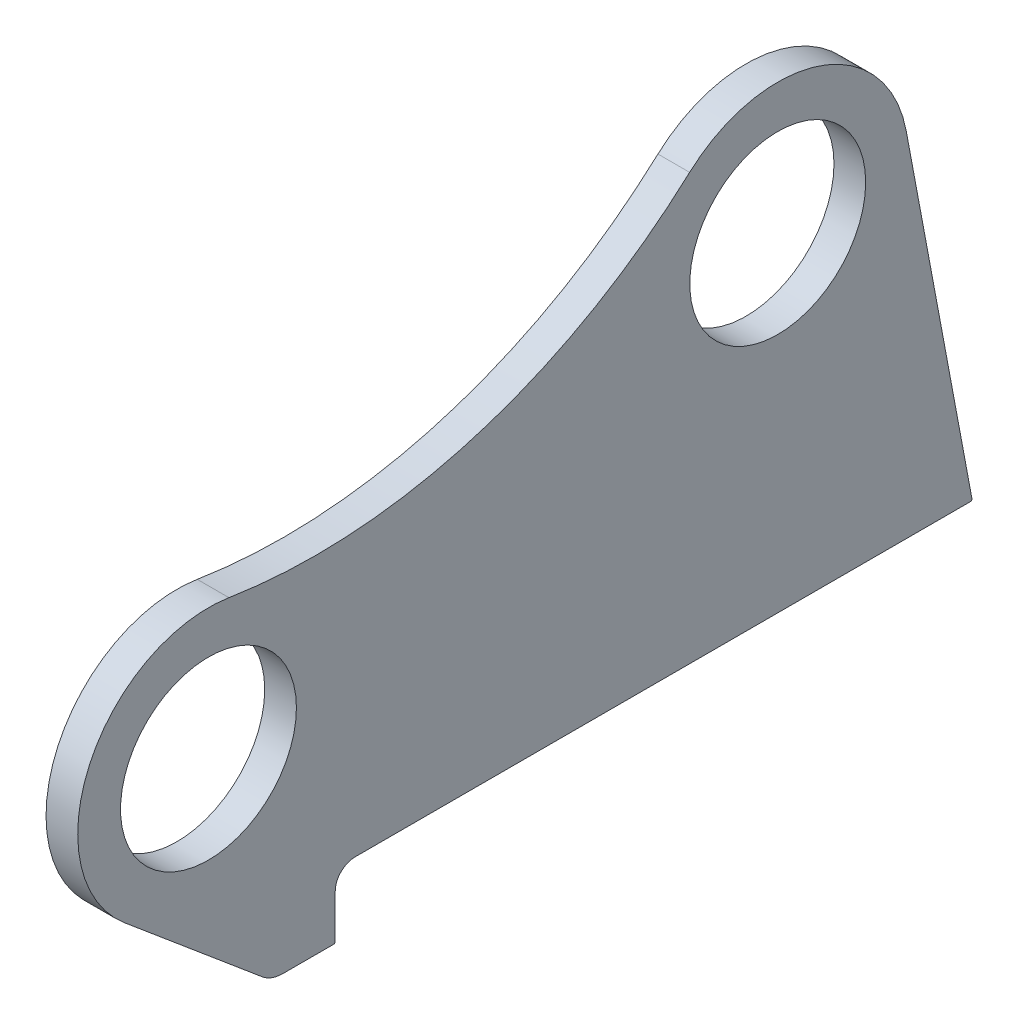
ISO-10303-21;
HEADER;
FILE_DESCRIPTION(('STEP AP214'),'2;1');
FILE_NAME('part.step','',(''),(''),'','','');
FILE_SCHEMA(('AUTOMOTIVE_DESIGN { 1 0 10303 214 1 1 1 1 }'));
ENDSEC;
DATA;
#1=APPLICATION_CONTEXT('core data for automotive mechanical design processes');
#2=APPLICATION_PROTOCOL_DEFINITION('international standard','automotive_design',2000,#1);
#3=PRODUCT_CONTEXT('',#1,'mechanical');
#4=PRODUCT('Part','Part','',(#3));
#5=PRODUCT_RELATED_PRODUCT_CATEGORY('part','',(#4));
#6=PRODUCT_DEFINITION_FORMATION('','',#4);
#7=PRODUCT_DEFINITION_CONTEXT('part definition',#1,'design');
#8=PRODUCT_DEFINITION('design','',#6,#7);
#9=PRODUCT_DEFINITION_SHAPE('','',#8);
#10=(LENGTH_UNIT() NAMED_UNIT(*) SI_UNIT(.MILLI.,.METRE.));
#11=(NAMED_UNIT(*) PLANE_ANGLE_UNIT() SI_UNIT($,.RADIAN.));
#12=(NAMED_UNIT(*) SI_UNIT($,.STERADIAN.) SOLID_ANGLE_UNIT());
#13=UNCERTAINTY_MEASURE_WITH_UNIT(LENGTH_MEASURE(1.E-05),#10,'distance_accuracy_value','');
#14=(GEOMETRIC_REPRESENTATION_CONTEXT(3) GLOBAL_UNCERTAINTY_ASSIGNED_CONTEXT((#13)) GLOBAL_UNIT_ASSIGNED_CONTEXT((#10,
#11,#12)) REPRESENTATION_CONTEXT('',''));
#15=CARTESIAN_POINT('',(0.,0.,0.));
#16=DIRECTION('',(0.,0.,1.));
#17=DIRECTION('',(1.,0.,0.));
#18=AXIS2_PLACEMENT_3D('',#15,#16,#17);
#19=CARTESIAN_POINT('',(-20.,527.155619983624,12.2185400245114));
#20=DIRECTION('',(1.,0.,0.));
#21=DIRECTION('',(0.,0.,-1.));
#22=AXIS2_PLACEMENT_3D('',#19,#20,#21);
#23=CYLINDRICAL_SURFACE('',#22,350.);
#24=CARTESIAN_POINT('',(0.,527.155619983624,12.2185400245114));
#25=DIRECTION('',(-1.,0.,0.));
#26=DIRECTION('',(0.,0.,-1.));
#27=AXIS2_PLACEMENT_3D('',#24,#25,#26);
#28=CIRCLE('',#27,350.);
#29=CARTESIAN_POINT('',(0.,268.558327081387,-223.636161229534));
#30=VERTEX_POINT('',#29);
#31=CARTESIAN_POINT('',(0.,181.480551788787,67.0705885595889));
#32=VERTEX_POINT('',#31);
#33=EDGE_CURVE('E179',#30,#32,#28,.T.);
#34=ORIENTED_EDGE('',*,*,#33,.F.);
#35=DIRECTION('',(1.,0.,0.));
#36=VECTOR('',#35,1.);
#37=CARTESIAN_POINT('',(-20.,268.558327081387,-223.636161229534));
#38=LINE('',#37,#36);
#39=CARTESIAN_POINT('',(-20.,268.558327081387,-223.636161229534));
#40=VERTEX_POINT('',#39);
#41=EDGE_CURVE('E152',#40,#30,#38,.T.);
#42=ORIENTED_EDGE('',*,*,#41,.F.);
#43=CARTESIAN_POINT('',(-20.,527.155619983624,12.2185400245114));
#44=DIRECTION('',(-1.,0.,0.));
#45=DIRECTION('',(0.,0.,-1.));
#46=AXIS2_PLACEMENT_3D('',#43,#44,#45);
#47=CIRCLE('',#46,350.);
#48=CARTESIAN_POINT('',(-20.,181.480551788787,67.0705885595889));
#49=VERTEX_POINT('',#48);
#50=EDGE_CURVE('E146',#40,#49,#47,.T.);
#51=ORIENTED_EDGE('',*,*,#50,.T.);
#52=DIRECTION('',(1.,0.,0.));
#53=VECTOR('',#52,1.);
#54=CARTESIAN_POINT('',(-20.,181.480551788787,67.0705885595889));
#55=LINE('',#54,#53);
#56=EDGE_CURVE('E128',#49,#32,#55,.T.);
#57=ORIENTED_EDGE('',*,*,#56,.T.);
#58=EDGE_LOOP('',(#34,#42,#51,#57));
#59=FACE_BOUND('',#58,.T.);
#60=ADVANCED_FACE('F39',(#59),#23,.F.);
#61=CARTESIAN_POINT('',(-20.,207.603250897289,-279.230483667987));
#62=DIRECTION('',(1.,0.,0.));
#63=DIRECTION('',(0.,0.,-1.));
#64=AXIS2_PLACEMENT_3D('',#61,#62,#63);
#65=CYLINDRICAL_SURFACE('',#64,82.5);
#66=CARTESIAN_POINT('',(0.,207.603250897289,-279.230483667987));
#67=DIRECTION('',(1.,0.,0.));
#68=DIRECTION('',(0.,0.,-1.));
#69=AXIS2_PLACEMENT_3D('',#66,#67,#68);
#70=CIRCLE('',#69,82.5);
#71=CARTESIAN_POINT('',(0.,222.774084628705,-360.323614103886));
#72=VERTEX_POINT('',#71);
#73=EDGE_CURVE('E153',#72,#30,#70,.T.);
#74=ORIENTED_EDGE('',*,*,#73,.F.);
#75=DIRECTION('',(1.,0.,0.));
#76=VECTOR('',#75,1.);
#77=CARTESIAN_POINT('',(-20.,222.774084628705,-360.323614103886));
#78=LINE('',#77,#76);
#79=CARTESIAN_POINT('',(-20.,222.774084628705,-360.323614103886));
#80=VERTEX_POINT('',#79);
#81=EDGE_CURVE('E203',#80,#72,#78,.T.);
#82=ORIENTED_EDGE('',*,*,#81,.F.);
#83=CARTESIAN_POINT('',(-20.,207.603250897289,-279.230483667987));
#84=DIRECTION('',(1.,0.,0.));
#85=DIRECTION('',(0.,0.,-1.));
#86=AXIS2_PLACEMENT_3D('',#83,#84,#85);
#87=CIRCLE('',#86,82.5);
#88=EDGE_CURVE('E139',#80,#40,#87,.T.);
#89=ORIENTED_EDGE('',*,*,#88,.T.);
#90=ORIENTED_EDGE('',*,*,#41,.T.);
#91=EDGE_LOOP('',(#74,#82,#89,#90));
#92=FACE_BOUND('',#91,.T.);
#93=ADVANCED_FACE('F244',(#92),#65,.T.);
#94=CARTESIAN_POINT('',(-20.,0.,-402.));
#95=DIRECTION('',(0.,0.183888893714131,-0.982947035586655));
#96=DIRECTION('',(0.,0.982947035586655,0.183888893714131));
#97=AXIS2_PLACEMENT_3D('',#94,#95,#96);
#98=PLANE('',#97);
#99=DIRECTION('',(0.,0.982947035586655,0.183888893714131));
#100=VECTOR('',#99,1.);
#101=CARTESIAN_POINT('',(0.,0.,-402.));
#102=LINE('',#101,#100);
#103=CARTESIAN_POINT('',(0.,1.18388889371413,-401.778519074717));
#104=VERTEX_POINT('',#103);
#105=EDGE_CURVE('E156',#104,#72,#102,.T.);
#106=ORIENTED_EDGE('',*,*,#105,.F.);
#107=DIRECTION('',(1.,0.,0.));
#108=VECTOR('',#107,1.);
#109=CARTESIAN_POINT('',(-20.,1.18388889371413,-401.778519074717));
#110=LINE('',#109,#108);
#111=CARTESIAN_POINT('',(-20.,1.18388889371413,-401.778519074717));
#112=VERTEX_POINT('',#111);
#113=EDGE_CURVE('E222',#104,#112,#110,.F.);
#114=ORIENTED_EDGE('',*,*,#113,.T.);
#115=DIRECTION('',(0.,0.982947035586655,0.183888893714131));
#116=VECTOR('',#115,1.);
#117=CARTESIAN_POINT('',(-20.,0.,-402.));
#118=LINE('',#117,#116);
#119=EDGE_CURVE('E176',#112,#80,#118,.T.);
#120=ORIENTED_EDGE('',*,*,#119,.T.);
#121=ORIENTED_EDGE('',*,*,#81,.T.);
#122=EDGE_LOOP('',(#106,#114,#120,#121));
#123=FACE_BOUND('',#122,.T.);
#124=ADVANCED_FACE('F270',(#123),#98,.T.);
#125=CARTESIAN_POINT('',(-20.,0.,-12.5));
#126=DIRECTION('',(0.,-1.,0.));
#127=DIRECTION('',(0.,0.,-1.));
#128=AXIS2_PLACEMENT_3D('',#125,#126,#127);
#129=PLANE('',#128);
#130=DIRECTION('',(0.,0.,-1.));
#131=VECTOR('',#130,1.);
#132=CARTESIAN_POINT('',(-20.,0.,-12.5));
#133=LINE('',#132,#131);
#134=CARTESIAN_POINT('',(-20.,0.,-12.5));
#135=VERTEX_POINT('',#134);
#136=CARTESIAN_POINT('',(-20.,0.,-400.795572039131));
#137=VERTEX_POINT('',#136);
#138=EDGE_CURVE('E173',#135,#137,#133,.T.);
#139=ORIENTED_EDGE('',*,*,#138,.T.);
#140=DIRECTION('',(1.,0.,0.));
#141=VECTOR('',#140,1.);
#142=CARTESIAN_POINT('',(-20.,0.,-400.795572039131));
#143=LINE('',#142,#141);
#144=CARTESIAN_POINT('',(0.,0.,-400.795572039131));
#145=VERTEX_POINT('',#144);
#146=EDGE_CURVE('E202',#137,#145,#143,.T.);
#147=ORIENTED_EDGE('',*,*,#146,.T.);
#148=DIRECTION('',(0.,0.,-1.));
#149=VECTOR('',#148,1.);
#150=CARTESIAN_POINT('',(0.,0.,-12.5));
#151=LINE('',#150,#149);
#152=CARTESIAN_POINT('',(0.,0.,-12.5));
#153=VERTEX_POINT('',#152);
#154=EDGE_CURVE('E197',#153,#145,#151,.T.);
#155=ORIENTED_EDGE('',*,*,#154,.F.);
#156=DIRECTION('',(1.,0.,0.));
#157=VECTOR('',#156,1.);
#158=CARTESIAN_POINT('',(-20.,0.,-12.5));
#159=LINE('',#158,#157);
#160=EDGE_CURVE('E206',#135,#153,#159,.T.);
#161=ORIENTED_EDGE('',*,*,#160,.F.);
#162=EDGE_LOOP('',(#139,#147,#155,#161));
#163=FACE_BOUND('',#162,.T.);
#164=ADVANCED_FACE('F254',(#163),#129,.T.);
#165=CARTESIAN_POINT('',(-20.,-12.5,-12.5));
#166=DIRECTION('',(1.,0.,0.));
#167=DIRECTION('',(0.,0.,-1.));
#168=AXIS2_PLACEMENT_3D('',#165,#166,#167);
#169=CYLINDRICAL_SURFACE('',#168,12.5);
#170=CARTESIAN_POINT('',(0.,-12.5,-12.5));
#171=DIRECTION('',(-1.,0.,0.));
#172=DIRECTION('',(0.,0.,1.));
#173=AXIS2_PLACEMENT_3D('',#170,#171,#172);
#174=CIRCLE('',#173,12.5);
#175=CARTESIAN_POINT('',(0.,-12.5,0.));
#176=VERTEX_POINT('',#175);
#177=EDGE_CURVE('E194',#176,#153,#174,.T.);
#178=ORIENTED_EDGE('',*,*,#177,.F.);
#179=DIRECTION('',(1.,0.,0.));
#180=VECTOR('',#179,1.);
#181=CARTESIAN_POINT('',(-20.,-12.5,0.));
#182=LINE('',#181,#180);
#183=CARTESIAN_POINT('',(-20.,-12.5,0.));
#184=VERTEX_POINT('',#183);
#185=EDGE_CURVE('E208',#184,#176,#182,.T.);
#186=ORIENTED_EDGE('',*,*,#185,.F.);
#187=CARTESIAN_POINT('',(-20.,-12.5,-12.5));
#188=DIRECTION('',(-1.,0.,0.));
#189=DIRECTION('',(0.,0.,1.));
#190=AXIS2_PLACEMENT_3D('',#187,#188,#189);
#191=CIRCLE('',#190,12.5);
#192=EDGE_CURVE('E170',#184,#135,#191,.T.);
#193=ORIENTED_EDGE('',*,*,#192,.T.);
#194=ORIENTED_EDGE('',*,*,#160,.T.);
#195=EDGE_LOOP('',(#178,#186,#193,#194));
#196=FACE_BOUND('',#195,.T.);
#197=ADVANCED_FACE('F258',(#196),#169,.F.);
#198=CARTESIAN_POINT('',(-20.,-41.,0.));
#199=DIRECTION('',(0.,0.,-1.));
#200=DIRECTION('',(-1.,0.,0.));
#201=AXIS2_PLACEMENT_3D('',#198,#199,#200);
#202=PLANE('',#201);
#203=DIRECTION('',(0.,1.,0.));
#204=VECTOR('',#203,1.);
#205=CARTESIAN_POINT('',(0.,-41.,0.));
#206=LINE('',#205,#204);
#207=CARTESIAN_POINT('',(0.,-40.,0.));
#208=VERTEX_POINT('',#207);
#209=EDGE_CURVE('E192',#208,#176,#206,.T.);
#210=ORIENTED_EDGE('',*,*,#209,.F.);
#211=DIRECTION('',(1.,0.,0.));
#212=VECTOR('',#211,1.);
#213=CARTESIAN_POINT('',(-20.,-40.,0.));
#214=LINE('',#213,#212);
#215=CARTESIAN_POINT('',(-20.,-40.,0.));
#216=VERTEX_POINT('',#215);
#217=EDGE_CURVE('E11',#208,#216,#214,.F.);
#218=ORIENTED_EDGE('',*,*,#217,.T.);
#219=DIRECTION('',(0.,1.,0.));
#220=VECTOR('',#219,1.);
#221=CARTESIAN_POINT('',(-20.,-41.,0.));
#222=LINE('',#221,#220);
#223=EDGE_CURVE('E168',#216,#184,#222,.T.);
#224=ORIENTED_EDGE('',*,*,#223,.T.);
#225=ORIENTED_EDGE('',*,*,#185,.T.);
#226=EDGE_LOOP('',(#210,#218,#224,#225));
#227=FACE_BOUND('',#226,.T.);
#228=ADVANCED_FACE('F281',(#227),#202,.T.);
#229=CARTESIAN_POINT('',(-20.,-41.,0.));
#230=DIRECTION('',(0.,-1.,0.));
#231=DIRECTION('',(0.,0.,-1.));
#232=AXIS2_PLACEMENT_3D('',#229,#230,#231);
#233=PLANE('',#232);
#234=DIRECTION('',(0.,0.,-1.));
#235=VECTOR('',#234,1.);
#236=CARTESIAN_POINT('',(-20.,-41.,0.));
#237=LINE('',#236,#235);
#238=CARTESIAN_POINT('',(-20.,-41.,33.1096120214944));
#239=VERTEX_POINT('',#238);
#240=CARTESIAN_POINT('',(-20.,-41.,1.));
#241=VERTEX_POINT('',#240);
#242=EDGE_CURVE('E166',#239,#241,#237,.T.);
#243=ORIENTED_EDGE('',*,*,#242,.T.);
#244=DIRECTION('',(1.,0.,0.));
#245=VECTOR('',#244,1.);
#246=CARTESIAN_POINT('',(-20.,-41.,1.));
#247=LINE('',#246,#245);
#248=CARTESIAN_POINT('',(0.,-41.,1.));
#249=VERTEX_POINT('',#248);
#250=EDGE_CURVE('E47',#241,#249,#247,.T.);
#251=ORIENTED_EDGE('',*,*,#250,.T.);
#252=DIRECTION('',(0.,0.,-1.));
#253=VECTOR('',#252,1.);
#254=CARTESIAN_POINT('',(0.,-41.,0.));
#255=LINE('',#254,#253);
#256=CARTESIAN_POINT('',(0.,-41.,33.1096120214944));
#257=VERTEX_POINT('',#256);
#258=EDGE_CURVE('E189',#257,#249,#255,.T.);
#259=ORIENTED_EDGE('',*,*,#258,.F.);
#260=DIRECTION('',(1.,0.,0.));
#261=VECTOR('',#260,1.);
#262=CARTESIAN_POINT('',(-20.,-41.,33.1096120214944));
#263=LINE('',#262,#261);
#264=EDGE_CURVE('E211',#239,#257,#263,.T.);
#265=ORIENTED_EDGE('',*,*,#264,.F.);
#266=EDGE_LOOP('',(#243,#251,#259,#265));
#267=FACE_BOUND('',#266,.T.);
#268=ADVANCED_FACE('F230',(#267),#233,.T.);
#269=CARTESIAN_POINT('',(-20.,-21.,33.1096120214943));
#270=DIRECTION('',(1.,0.,0.));
#271=DIRECTION('',(0.,0.,-1.));
#272=AXIS2_PLACEMENT_3D('',#269,#270,#271);
#273=CYLINDRICAL_SURFACE('',#272,20.);
#274=CARTESIAN_POINT('',(0.,-21.,33.1096120214943));
#275=DIRECTION('',(1.,0.,0.));
#276=DIRECTION('',(0.,0.,-1.));
#277=AXIS2_PLACEMENT_3D('',#274,#275,#276);
#278=CIRCLE('',#277,20.);
#279=CARTESIAN_POINT('',(0.,-36.3151421434658,45.972209781101));
#280=VERTEX_POINT('',#279);
#281=EDGE_CURVE('E186',#280,#257,#278,.T.);
#282=ORIENTED_EDGE('',*,*,#281,.F.);
#283=DIRECTION('',(1.,0.,0.));
#284=VECTOR('',#283,1.);
#285=CARTESIAN_POINT('',(-20.,-36.3151421434658,45.972209781101));
#286=LINE('',#285,#284);
#287=CARTESIAN_POINT('',(-20.,-36.3151421434658,45.972209781101));
#288=VERTEX_POINT('',#287);
#289=EDGE_CURVE('E213',#288,#280,#286,.T.);
#290=ORIENTED_EDGE('',*,*,#289,.F.);
#291=CARTESIAN_POINT('',(-20.,-21.,33.1096120214943));
#292=DIRECTION('',(1.,0.,0.));
#293=DIRECTION('',(0.,0.,-1.));
#294=AXIS2_PLACEMENT_3D('',#291,#292,#293);
#295=CIRCLE('',#294,20.);
#296=EDGE_CURVE('E163',#288,#239,#295,.T.);
#297=ORIENTED_EDGE('',*,*,#296,.T.);
#298=ORIENTED_EDGE('',*,*,#264,.T.);
#299=EDGE_LOOP('',(#282,#290,#297,#298));
#300=FACE_BOUND('',#299,.T.);
#301=ADVANCED_FACE('F237',(#300),#273,.T.);
#302=CARTESIAN_POINT('',(-20.,36.8250386582074,133.058215758378));
#303=DIRECTION('',(0.,-0.765757107173288,0.643129887980334));
#304=DIRECTION('',(0.,-0.643129887980334,-0.765757107173288));
#305=AXIS2_PLACEMENT_3D('',#302,#303,#304);
#306=PLANE('',#305);
#307=DIRECTION('',(0.,-0.643129887980334,-0.765757107173288));
#308=VECTOR('',#307,1.);
#309=CARTESIAN_POINT('',(0.,36.8250386582074,133.058215758378));
#310=LINE('',#309,#308);
#311=CARTESIAN_POINT('',(0.,36.8250386582073,133.058215758378));
#312=VERTEX_POINT('',#311);
#313=EDGE_CURVE('E183',#312,#280,#310,.T.);
#314=ORIENTED_EDGE('',*,*,#313,.F.);
#315=DIRECTION('',(1.,0.,0.));
#316=VECTOR('',#315,1.);
#317=CARTESIAN_POINT('',(-20.,36.8250386582073,133.058215758378));
#318=LINE('',#317,#316);
#319=CARTESIAN_POINT('',(-20.,36.8250386582073,133.058215758378));
#320=VERTEX_POINT('',#319);
#321=EDGE_CURVE('E138',#320,#312,#318,.T.);
#322=ORIENTED_EDGE('',*,*,#321,.F.);
#323=DIRECTION('',(0.,-0.643129887980334,-0.765757107173288));
#324=VECTOR('',#323,1.);
#325=CARTESIAN_POINT('',(-20.,36.8250386582074,133.058215758378));
#326=LINE('',#325,#324);
#327=EDGE_CURVE('E150',#320,#288,#326,.T.);
#328=ORIENTED_EDGE('',*,*,#327,.T.);
#329=ORIENTED_EDGE('',*,*,#289,.T.);
#330=EDGE_LOOP('',(#314,#322,#328,#329));
#331=FACE_BOUND('',#330,.T.);
#332=ADVANCED_FACE('F239',(#331),#306,.T.);
#333=CARTESIAN_POINT('',(-20.,100.000000000004,80.));
#334=DIRECTION('',(1.,0.,0.));
#335=DIRECTION('',(0.,0.,-1.));
#336=AXIS2_PLACEMENT_3D('',#333,#334,#335);
#337=CYLINDRICAL_SURFACE('',#336,82.5);
#338=CARTESIAN_POINT('',(0.,100.000000000004,80.));
#339=DIRECTION('',(1.,0.,0.));
#340=DIRECTION('',(0.,0.,-1.));
#341=AXIS2_PLACEMENT_3D('',#338,#339,#340);
#342=CIRCLE('',#341,82.5);
#343=EDGE_CURVE('E133',#32,#312,#342,.T.);
#344=ORIENTED_EDGE('',*,*,#343,.F.);
#345=ORIENTED_EDGE('',*,*,#56,.F.);
#346=CARTESIAN_POINT('',(-20.,100.000000000004,80.));
#347=DIRECTION('',(1.,0.,0.));
#348=DIRECTION('',(0.,0.,-1.));
#349=AXIS2_PLACEMENT_3D('',#346,#347,#348);
#350=CIRCLE('',#349,82.5);
#351=EDGE_CURVE('E131',#49,#320,#350,.T.);
#352=ORIENTED_EDGE('',*,*,#351,.T.);
#353=ORIENTED_EDGE('',*,*,#321,.T.);
#354=EDGE_LOOP('',(#344,#345,#352,#353));
#355=FACE_BOUND('',#354,.T.);
#356=ADVANCED_FACE('F130',(#355),#337,.T.);
#357=CARTESIAN_POINT('',(-20.,527.155619983624,12.2185400245114));
#358=DIRECTION('',(1.,0.,0.));
#359=DIRECTION('',(0.,0.,-1.));
#360=AXIS2_PLACEMENT_3D('',#357,#358,#359);
#361=PLANE('',#360);
#362=CARTESIAN_POINT('',(-20.,207.603250897289,-279.230483667987));
#363=DIRECTION('',(1.,0.,0.));
#364=DIRECTION('',(0.,0.,-1.));
#365=AXIS2_PLACEMENT_3D('',#362,#363,#364);
#366=CIRCLE('',#365,55.5);
#367=CARTESIAN_POINT('',(-20.,207.603250897289,-334.730483667987));
#368=VERTEX_POINT('',#367);
#369=EDGE_CURVE('E307',#368,#368,#366,.T.);
#370=ORIENTED_EDGE('',*,*,#369,.T.);
#371=EDGE_LOOP('',(#370));
#372=FACE_BOUND('',#371,.T.);
#373=CARTESIAN_POINT('',(-20.,100.000000000004,80.));
#374=DIRECTION('',(1.,0.,0.));
#375=DIRECTION('',(0.,0.,-1.));
#376=AXIS2_PLACEMENT_3D('',#373,#374,#375);
#377=CIRCLE('',#376,55.5);
#378=CARTESIAN_POINT('',(-20.,100.000000000004,24.5));
#379=VERTEX_POINT('',#378);
#380=EDGE_CURVE('E181',#379,#379,#377,.T.);
#381=ORIENTED_EDGE('',*,*,#380,.T.);
#382=EDGE_LOOP('',(#381));
#383=FACE_BOUND('',#382,.T.);
#384=ORIENTED_EDGE('',*,*,#119,.F.);
#385=CARTESIAN_POINT('',(-20.,1.,-400.795572039131));
#386=DIRECTION('',(1.,0.,0.));
#387=DIRECTION('',(0.,0.,-1.));
#388=AXIS2_PLACEMENT_3D('',#385,#386,#387);
#389=CIRCLE('',#388,1.);
#390=EDGE_CURVE('E225',#112,#137,#389,.F.);
#391=ORIENTED_EDGE('',*,*,#390,.T.);
#392=ORIENTED_EDGE('',*,*,#138,.F.);
#393=ORIENTED_EDGE('',*,*,#192,.F.);
#394=ORIENTED_EDGE('',*,*,#223,.F.);
#395=CARTESIAN_POINT('',(-20.,-40.,1.));
#396=DIRECTION('',(1.,0.,0.));
#397=DIRECTION('',(0.,0.,-1.));
#398=AXIS2_PLACEMENT_3D('',#395,#396,#397);
#399=CIRCLE('',#398,1.);
#400=EDGE_CURVE('E54',#216,#241,#399,.F.);
#401=ORIENTED_EDGE('',*,*,#400,.T.);
#402=ORIENTED_EDGE('',*,*,#242,.F.);
#403=ORIENTED_EDGE('',*,*,#296,.F.);
#404=ORIENTED_EDGE('',*,*,#327,.F.);
#405=ORIENTED_EDGE('',*,*,#351,.F.);
#406=ORIENTED_EDGE('',*,*,#50,.F.);
#407=ORIENTED_EDGE('',*,*,#88,.F.);
#408=EDGE_LOOP('',(#384,#391,#392,#393,#394,#401,#402,#403,#404,#405,#406,#407));
#409=FACE_BOUND('',#408,.T.);
#410=ADVANCED_FACE('F144',(#372,#383,#409),#361,.F.);
#411=CARTESIAN_POINT('',(0.,527.155619983624,12.2185400245114));
#412=DIRECTION('',(1.,0.,0.));
#413=DIRECTION('',(0.,0.,-1.));
#414=AXIS2_PLACEMENT_3D('',#411,#412,#413);
#415=PLANE('',#414);
#416=CARTESIAN_POINT('',(0.,207.603250897289,-279.230483667987));
#417=DIRECTION('',(1.,0.,0.));
#418=DIRECTION('',(0.,0.,-1.));
#419=AXIS2_PLACEMENT_3D('',#416,#417,#418);
#420=CIRCLE('',#419,55.5);
#421=CARTESIAN_POINT('',(0.,207.603250897289,-334.730483667987));
#422=VERTEX_POINT('',#421);
#423=EDGE_CURVE('E310',#422,#422,#420,.T.);
#424=ORIENTED_EDGE('',*,*,#423,.F.);
#425=EDGE_LOOP('',(#424));
#426=FACE_BOUND('',#425,.T.);
#427=CARTESIAN_POINT('',(0.,100.000000000004,80.));
#428=DIRECTION('',(1.,0.,0.));
#429=DIRECTION('',(0.,0.,-1.));
#430=AXIS2_PLACEMENT_3D('',#427,#428,#429);
#431=CIRCLE('',#430,55.5);
#432=CARTESIAN_POINT('',(0.,100.000000000004,24.5));
#433=VERTEX_POINT('',#432);
#434=EDGE_CURVE('E159',#433,#433,#431,.T.);
#435=ORIENTED_EDGE('',*,*,#434,.F.);
#436=EDGE_LOOP('',(#435));
#437=FACE_BOUND('',#436,.T.);
#438=ORIENTED_EDGE('',*,*,#154,.T.);
#439=CARTESIAN_POINT('',(0.,1.,-400.795572039131));
#440=DIRECTION('',(1.,0.,0.));
#441=DIRECTION('',(0.,0.,-1.));
#442=AXIS2_PLACEMENT_3D('',#439,#440,#441);
#443=CIRCLE('',#442,1.);
#444=EDGE_CURVE('E220',#145,#104,#443,.T.);
#445=ORIENTED_EDGE('',*,*,#444,.T.);
#446=ORIENTED_EDGE('',*,*,#105,.T.);
#447=ORIENTED_EDGE('',*,*,#73,.T.);
#448=ORIENTED_EDGE('',*,*,#33,.T.);
#449=ORIENTED_EDGE('',*,*,#343,.T.);
#450=ORIENTED_EDGE('',*,*,#313,.T.);
#451=ORIENTED_EDGE('',*,*,#281,.T.);
#452=ORIENTED_EDGE('',*,*,#258,.T.);
#453=CARTESIAN_POINT('',(0.,-40.,1.));
#454=DIRECTION('',(1.,0.,0.));
#455=DIRECTION('',(0.,0.,-1.));
#456=AXIS2_PLACEMENT_3D('',#453,#454,#455);
#457=CIRCLE('',#456,1.);
#458=EDGE_CURVE('E218',#249,#208,#457,.T.);
#459=ORIENTED_EDGE('',*,*,#458,.T.);
#460=ORIENTED_EDGE('',*,*,#209,.T.);
#461=ORIENTED_EDGE('',*,*,#177,.T.);
#462=EDGE_LOOP('',(#438,#445,#446,#447,#448,#449,#450,#451,#452,#459,#460,#461));
#463=FACE_BOUND('',#462,.T.);
#464=ADVANCED_FACE('F233',(#426,#437,#463),#415,.T.);
#465=CARTESIAN_POINT('',(-20.,100.000000000004,80.));
#466=DIRECTION('',(1.,0.,0.));
#467=DIRECTION('',(0.,0.,-1.));
#468=AXIS2_PLACEMENT_3D('',#465,#466,#467);
#469=CYLINDRICAL_SURFACE('',#468,55.5);
#470=ORIENTED_EDGE('',*,*,#380,.F.);
#471=EDGE_LOOP('',(#470));
#472=FACE_BOUND('',#471,.T.);
#473=ORIENTED_EDGE('',*,*,#434,.T.);
#474=EDGE_LOOP('',(#473));
#475=FACE_BOUND('',#474,.T.);
#476=ADVANCED_FACE('F292',(#472,#475),#469,.F.);
#477=CARTESIAN_POINT('',(-20.,207.603250897289,-279.230483667987));
#478=DIRECTION('',(1.,0.,0.));
#479=DIRECTION('',(0.,0.,-1.));
#480=AXIS2_PLACEMENT_3D('',#477,#478,#479);
#481=CYLINDRICAL_SURFACE('',#480,55.5);
#482=ORIENTED_EDGE('',*,*,#369,.F.);
#483=EDGE_LOOP('',(#482));
#484=FACE_BOUND('',#483,.T.);
#485=ORIENTED_EDGE('',*,*,#423,.T.);
#486=EDGE_LOOP('',(#485));
#487=FACE_BOUND('',#486,.T.);
#488=ADVANCED_FACE('F264',(#484,#487),#481,.F.);
#489=CARTESIAN_POINT('',(-20.,1.,-400.795572039131));
#490=DIRECTION('',(1.,0.,0.));
#491=DIRECTION('',(0.,0.,-1.));
#492=AXIS2_PLACEMENT_3D('',#489,#490,#491);
#493=CYLINDRICAL_SURFACE('',#492,1.);
#494=ORIENTED_EDGE('',*,*,#390,.F.);
#495=ORIENTED_EDGE('',*,*,#113,.F.);
#496=ORIENTED_EDGE('',*,*,#444,.F.);
#497=ORIENTED_EDGE('',*,*,#146,.F.);
#498=EDGE_LOOP('',(#494,#495,#496,#497));
#499=FACE_BOUND('',#498,.T.);
#500=ADVANCED_FACE('F251',(#499),#493,.T.);
#501=CARTESIAN_POINT('',(-20.,-40.,1.));
#502=DIRECTION('',(1.,0.,0.));
#503=DIRECTION('',(0.,0.,-1.));
#504=AXIS2_PLACEMENT_3D('',#501,#502,#503);
#505=CYLINDRICAL_SURFACE('',#504,1.);
#506=ORIENTED_EDGE('',*,*,#400,.F.);
#507=ORIENTED_EDGE('',*,*,#217,.F.);
#508=ORIENTED_EDGE('',*,*,#458,.F.);
#509=ORIENTED_EDGE('',*,*,#250,.F.);
#510=EDGE_LOOP('',(#506,#507,#508,#509));
#511=FACE_BOUND('',#510,.T.);
#512=ADVANCED_FACE('F41',(#511),#505,.T.);
#513=CLOSED_SHELL('',(#60,#93,#124,#164,#197,#228,#268,#301,#332,#356,#410,#464,#476,#488,#500,#512));
#514=MANIFOLD_SOLID_BREP('B2',#513);
#515=ADVANCED_BREP_SHAPE_REPRESENTATION('',(#18,#514),#14);
#516=SHAPE_DEFINITION_REPRESENTATION(#9,#515);
ENDSEC;
END-ISO-10303-21;
